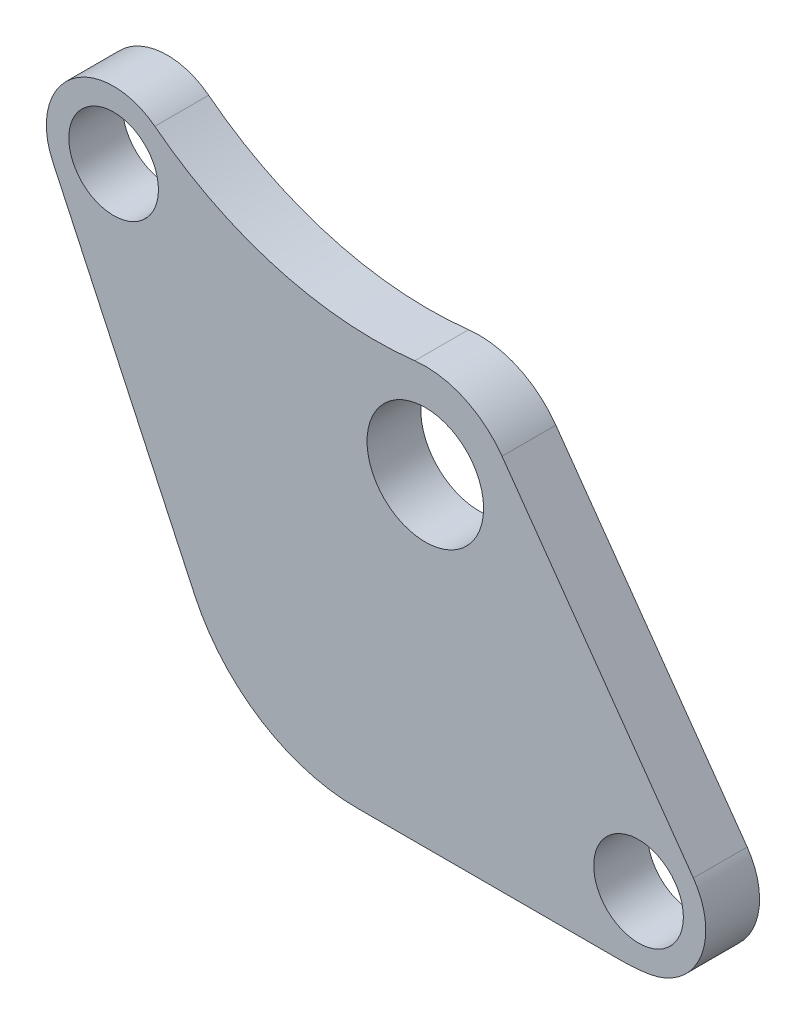
ISO-10303-21;
HEADER;
FILE_DESCRIPTION(('STEP AP214'),'2;1');
FILE_NAME('part.step','',(''),(''),'','','');
FILE_SCHEMA(('AUTOMOTIVE_DESIGN { 1 0 10303 214 1 1 1 1 }'));
ENDSEC;
DATA;
#1=APPLICATION_CONTEXT('core data for automotive mechanical design processes');
#2=APPLICATION_PROTOCOL_DEFINITION('international standard','automotive_design',2000,#1);
#3=PRODUCT_CONTEXT('',#1,'mechanical');
#4=PRODUCT('Part','Part','',(#3));
#5=PRODUCT_RELATED_PRODUCT_CATEGORY('part','',(#4));
#6=PRODUCT_DEFINITION_FORMATION('','',#4);
#7=PRODUCT_DEFINITION_CONTEXT('part definition',#1,'design');
#8=PRODUCT_DEFINITION('design','',#6,#7);
#9=PRODUCT_DEFINITION_SHAPE('','',#8);
#10=(LENGTH_UNIT() NAMED_UNIT(*) SI_UNIT(.MILLI.,.METRE.));
#11=(NAMED_UNIT(*) PLANE_ANGLE_UNIT() SI_UNIT($,.RADIAN.));
#12=(NAMED_UNIT(*) SI_UNIT($,.STERADIAN.) SOLID_ANGLE_UNIT());
#13=UNCERTAINTY_MEASURE_WITH_UNIT(LENGTH_MEASURE(1.E-05),#10,'distance_accuracy_value','');
#14=(GEOMETRIC_REPRESENTATION_CONTEXT(3) GLOBAL_UNCERTAINTY_ASSIGNED_CONTEXT((#13)) GLOBAL_UNIT_ASSIGNED_CONTEXT((#10,
#11,#12)) REPRESENTATION_CONTEXT('',''));
#15=CARTESIAN_POINT('',(0.,0.,0.));
#16=DIRECTION('',(0.,0.,1.));
#17=DIRECTION('',(1.,0.,0.));
#18=AXIS2_PLACEMENT_3D('',#15,#16,#17);
#19=CARTESIAN_POINT('',(-17.3843134845393,6.32737265152489,3.));
#20=DIRECTION('',(0.,0.,1.));
#21=DIRECTION('',(1.,0.,0.));
#22=AXIS2_PLACEMENT_3D('',#19,#20,#21);
#23=PLANE('',#22);
#24=CARTESIAN_POINT('',(11.891570779201,-14.1718221977011,3.));
#25=DIRECTION('',(0.,0.,1.));
#26=DIRECTION('',(1.,0.,0.));
#27=AXIS2_PLACEMENT_3D('',#24,#25,#26);
#28=CIRCLE('',#27,2.5);
#29=CARTESIAN_POINT('',(14.391570779201,-14.1718221977011,3.));
#30=VERTEX_POINT('',#29);
#31=EDGE_CURVE('E208',#30,#30,#28,.T.);
#32=ORIENTED_EDGE('',*,*,#31,.F.);
#33=EDGE_LOOP('',(#32));
#34=FACE_BOUND('',#33,.T.);
#35=DIRECTION('',(0.422618261740697,-0.906307787036651,0.));
#36=VECTOR('',#35,1.);
#37=CARTESIAN_POINT('',(-20.7829676859267,4.74255416999728,3.));
#38=LINE('',#37,#36);
#39=CARTESIAN_POINT('',(-20.7829676859267,4.74255416999728,3.));
#40=VERTEX_POINT('',#39);
#41=CARTESIAN_POINT('',(-12.8703157727437,-12.226182617407,3.));
#42=VERTEX_POINT('',#41);
#43=EDGE_CURVE('E107',#40,#42,#38,.T.);
#44=ORIENTED_EDGE('',*,*,#43,.T.);
#45=CARTESIAN_POINT('',(-3.80723790237724,-8.,3.));
#46=DIRECTION('',(0.,0.,1.));
#47=DIRECTION('',(1.,0.,0.));
#48=AXIS2_PLACEMENT_3D('',#45,#46,#47);
#49=CIRCLE('',#48,10.);
#50=CARTESIAN_POINT('',(-3.80723790237724,-18.,3.));
#51=VERTEX_POINT('',#50);
#52=EDGE_CURVE('E11',#42,#51,#49,.T.);
#53=ORIENTED_EDGE('',*,*,#52,.T.);
#54=DIRECTION('',(1.,0.,0.));
#55=VECTOR('',#54,1.);
#56=CARTESIAN_POINT('',(-10.1779405104522,-18.,3.));
#57=LINE('',#56,#55);
#58=CARTESIAN_POINT('',(10.9061212574274,-18.,3.));
#59=VERTEX_POINT('',#58);
#60=EDGE_CURVE('E116',#51,#59,#57,.T.);
#61=ORIENTED_EDGE('',*,*,#60,.T.);
#62=CARTESIAN_POINT('',(10.9061212574274,-8.,3.));
#63=DIRECTION('',(0.,0.,1.));
#64=DIRECTION('',(1.,0.,0.));
#65=AXIS2_PLACEMENT_3D('',#62,#63,#64);
#66=CIRCLE('',#65,10.);
#67=CARTESIAN_POINT('',(12.4828404922651,-17.8749155163218,3.));
#68=VERTEX_POINT('',#67);
#69=EDGE_CURVE('E199',#59,#68,#66,.T.);
#70=ORIENTED_EDGE('',*,*,#69,.T.);
#71=CARTESIAN_POINT('',(11.891570779201,-14.1718221977011,3.));
#72=DIRECTION('',(0.,0.,1.));
#73=DIRECTION('',(1.,0.,0.));
#74=AXIS2_PLACEMENT_3D('',#71,#72,#73);
#75=CIRCLE('',#74,3.75);
#76=CARTESIAN_POINT('',(14.9499384171909,-12.0018251030265,3.));
#77=VERTEX_POINT('',#76);
#78=EDGE_CURVE('E196',#68,#77,#75,.T.);
#79=ORIENTED_EDGE('',*,*,#78,.T.);
#80=DIRECTION('',(-0.578665891913218,0.815564703463974,0.));
#81=VECTOR('',#80,1.);
#82=CARTESIAN_POINT('',(4.27975347553941,3.03660439395303,3.));
#83=LINE('',#82,#81);
#84=CARTESIAN_POINT('',(4.27975347553941,3.03660439395303,3.));
#85=VERTEX_POINT('',#84);
#86=EDGE_CURVE('E193',#77,#85,#83,.T.);
#87=ORIENTED_EDGE('',*,*,#86,.T.);
#88=CARTESIAN_POINT('',(0.,0.,3.));
#89=DIRECTION('',(0.,0.,1.));
#90=DIRECTION('',(-1.,0.,0.));
#91=AXIS2_PLACEMENT_3D('',#88,#89,#90);
#92=CIRCLE('',#91,5.24759526419164);
#93=CARTESIAN_POINT('',(-0.58661243137298,5.21470439355149,3.));
#94=VERTEX_POINT('',#93);
#95=EDGE_CURVE('E190',#85,#94,#92,.T.);
#96=ORIENTED_EDGE('',*,*,#95,.T.);
#97=CARTESIAN_POINT('',(-2.82235052411761,25.0893484200655,3.));
#98=DIRECTION('',(0.,0.,-1.));
#99=DIRECTION('',(1.,0.,0.));
#100=AXIS2_PLACEMENT_3D('',#97,#98,#99);
#101=CIRCLE('',#100,20.);
#102=CARTESIAN_POINT('',(-15.085056174999,9.28978987813658,3.));
#103=VERTEX_POINT('',#102);
#104=EDGE_CURVE('E122',#94,#103,#101,.T.);
#105=ORIENTED_EDGE('',*,*,#104,.T.);
#106=CARTESIAN_POINT('',(-17.3843134845393,6.32737265152489,3.));
#107=DIRECTION('',(0.,0.,1.));
#108=DIRECTION('',(1.,0.,0.));
#109=AXIS2_PLACEMENT_3D('',#106,#107,#108);
#110=CIRCLE('',#109,3.75);
#111=EDGE_CURVE('E117',#103,#40,#110,.T.);
#112=ORIENTED_EDGE('',*,*,#111,.T.);
#113=EDGE_LOOP('',(#44,#53,#61,#70,#79,#87,#96,#105,#112));
#114=FACE_BOUND('',#113,.T.);
#115=CARTESIAN_POINT('',(-17.3843134845393,6.32737265152489,3.));
#116=DIRECTION('',(0.,0.,1.));
#117=DIRECTION('',(1.,0.,0.));
#118=AXIS2_PLACEMENT_3D('',#115,#116,#117);
#119=CIRCLE('',#118,2.5);
#120=CARTESIAN_POINT('',(-14.8843134845393,6.32737265152489,3.));
#121=VERTEX_POINT('',#120);
#122=EDGE_CURVE('E187',#121,#121,#119,.T.);
#123=ORIENTED_EDGE('',*,*,#122,.F.);
#124=EDGE_LOOP('',(#123));
#125=FACE_BOUND('',#124,.T.);
#126=CARTESIAN_POINT('',(0.,0.,3.));
#127=DIRECTION('',(0.,0.,1.));
#128=DIRECTION('',(1.,0.,0.));
#129=AXIS2_PLACEMENT_3D('',#126,#127,#128);
#130=CIRCLE('',#129,3.25);
#131=CARTESIAN_POINT('',(3.25,0.,3.));
#132=VERTEX_POINT('',#131);
#133=EDGE_CURVE('E216',#132,#132,#130,.T.);
#134=ORIENTED_EDGE('',*,*,#133,.F.);
#135=EDGE_LOOP('',(#134));
#136=FACE_BOUND('',#135,.T.);
#137=ADVANCED_FACE('F39',(#34,#114,#125,#136),#23,.T.);
#138=CARTESIAN_POINT('',(-17.3843134845393,6.32737265152489,0.));
#139=DIRECTION('',(0.,0.,1.));
#140=DIRECTION('',(1.,0.,0.));
#141=AXIS2_PLACEMENT_3D('',#138,#139,#140);
#142=PLANE('',#141);
#143=DIRECTION('',(1.,0.,0.));
#144=VECTOR('',#143,1.);
#145=CARTESIAN_POINT('',(-10.1779405104522,-18.,0.));
#146=LINE('',#145,#144);
#147=CARTESIAN_POINT('',(-3.80723790237724,-18.,0.));
#148=VERTEX_POINT('',#147);
#149=CARTESIAN_POINT('',(10.9061212574274,-18.,0.));
#150=VERTEX_POINT('',#149);
#151=EDGE_CURVE('E179',#148,#150,#146,.T.);
#152=ORIENTED_EDGE('',*,*,#151,.F.);
#153=CARTESIAN_POINT('',(-3.80723790237724,-8.,0.));
#154=DIRECTION('',(0.,0.,1.));
#155=DIRECTION('',(1.,0.,0.));
#156=AXIS2_PLACEMENT_3D('',#153,#154,#155);
#157=CIRCLE('',#156,10.);
#158=CARTESIAN_POINT('',(-12.8703157727437,-12.226182617407,0.));
#159=VERTEX_POINT('',#158);
#160=EDGE_CURVE('E62',#148,#159,#157,.F.);
#161=ORIENTED_EDGE('',*,*,#160,.T.);
#162=DIRECTION('',(0.422618261740697,-0.906307787036651,0.));
#163=VECTOR('',#162,1.);
#164=CARTESIAN_POINT('',(-20.7829676859267,4.74255416999728,0.));
#165=LINE('',#164,#163);
#166=CARTESIAN_POINT('',(-20.7829676859267,4.74255416999728,0.));
#167=VERTEX_POINT('',#166);
#168=EDGE_CURVE('E182',#167,#159,#165,.T.);
#169=ORIENTED_EDGE('',*,*,#168,.F.);
#170=CARTESIAN_POINT('',(-17.3843134845393,6.32737265152489,0.));
#171=DIRECTION('',(0.,0.,1.));
#172=DIRECTION('',(1.,0.,0.));
#173=AXIS2_PLACEMENT_3D('',#170,#171,#172);
#174=CIRCLE('',#173,3.75);
#175=CARTESIAN_POINT('',(-15.085056174999,9.28978987813658,0.));
#176=VERTEX_POINT('',#175);
#177=EDGE_CURVE('E131',#176,#167,#174,.T.);
#178=ORIENTED_EDGE('',*,*,#177,.F.);
#179=CARTESIAN_POINT('',(-2.82235052411761,25.0893484200655,0.));
#180=DIRECTION('',(0.,0.,-1.));
#181=DIRECTION('',(1.,0.,0.));
#182=AXIS2_PLACEMENT_3D('',#179,#180,#181);
#183=CIRCLE('',#182,20.);
#184=CARTESIAN_POINT('',(-0.58661243137298,5.21470439355149,0.));
#185=VERTEX_POINT('',#184);
#186=EDGE_CURVE('E127',#185,#176,#183,.T.);
#187=ORIENTED_EDGE('',*,*,#186,.F.);
#188=CARTESIAN_POINT('',(0.,0.,0.));
#189=DIRECTION('',(0.,0.,1.));
#190=DIRECTION('',(-1.,0.,0.));
#191=AXIS2_PLACEMENT_3D('',#188,#189,#190);
#192=CIRCLE('',#191,5.24759526419164);
#193=CARTESIAN_POINT('',(4.27975347553941,3.03660439395303,0.));
#194=VERTEX_POINT('',#193);
#195=EDGE_CURVE('E167',#194,#185,#192,.T.);
#196=ORIENTED_EDGE('',*,*,#195,.F.);
#197=DIRECTION('',(-0.578665891913218,0.815564703463974,0.));
#198=VECTOR('',#197,1.);
#199=CARTESIAN_POINT('',(4.27975347553941,3.03660439395303,0.));
#200=LINE('',#199,#198);
#201=CARTESIAN_POINT('',(14.9499384171909,-12.0018251030265,0.));
#202=VERTEX_POINT('',#201);
#203=EDGE_CURVE('E170',#202,#194,#200,.T.);
#204=ORIENTED_EDGE('',*,*,#203,.F.);
#205=CARTESIAN_POINT('',(11.891570779201,-14.1718221977011,0.));
#206=DIRECTION('',(0.,0.,1.));
#207=DIRECTION('',(1.,0.,0.));
#208=AXIS2_PLACEMENT_3D('',#205,#206,#207);
#209=CIRCLE('',#208,3.75);
#210=CARTESIAN_POINT('',(12.4828404922651,-17.8749155163218,0.));
#211=VERTEX_POINT('',#210);
#212=EDGE_CURVE('E173',#211,#202,#209,.T.);
#213=ORIENTED_EDGE('',*,*,#212,.F.);
#214=CARTESIAN_POINT('',(10.9061212574274,-8.,0.));
#215=DIRECTION('',(0.,0.,1.));
#216=DIRECTION('',(1.,0.,0.));
#217=AXIS2_PLACEMENT_3D('',#214,#215,#216);
#218=CIRCLE('',#217,10.);
#219=EDGE_CURVE('E176',#150,#211,#218,.T.);
#220=ORIENTED_EDGE('',*,*,#219,.F.);
#221=EDGE_LOOP('',(#152,#161,#169,#178,#187,#196,#204,#213,#220));
#222=FACE_BOUND('',#221,.T.);
#223=CARTESIAN_POINT('',(-17.3843134845393,6.32737265152489,0.));
#224=DIRECTION('',(0.,0.,1.));
#225=DIRECTION('',(1.,0.,0.));
#226=AXIS2_PLACEMENT_3D('',#223,#224,#225);
#227=CIRCLE('',#226,2.5);
#228=CARTESIAN_POINT('',(-14.8843134845393,6.32737265152489,0.));
#229=VERTEX_POINT('',#228);
#230=EDGE_CURVE('E204',#229,#229,#227,.T.);
#231=ORIENTED_EDGE('',*,*,#230,.T.);
#232=EDGE_LOOP('',(#231));
#233=FACE_BOUND('',#232,.T.);
#234=CARTESIAN_POINT('',(11.891570779201,-14.1718221977011,0.));
#235=DIRECTION('',(0.,0.,1.));
#236=DIRECTION('',(1.,0.,0.));
#237=AXIS2_PLACEMENT_3D('',#234,#235,#236);
#238=CIRCLE('',#237,2.5);
#239=CARTESIAN_POINT('',(14.391570779201,-14.1718221977011,0.));
#240=VERTEX_POINT('',#239);
#241=EDGE_CURVE('E212',#240,#240,#238,.T.);
#242=ORIENTED_EDGE('',*,*,#241,.T.);
#243=EDGE_LOOP('',(#242));
#244=FACE_BOUND('',#243,.T.);
#245=CARTESIAN_POINT('',(0.,0.,0.));
#246=DIRECTION('',(0.,0.,1.));
#247=DIRECTION('',(1.,0.,0.));
#248=AXIS2_PLACEMENT_3D('',#245,#246,#247);
#249=CIRCLE('',#248,3.25);
#250=CARTESIAN_POINT('',(3.25,0.,0.));
#251=VERTEX_POINT('',#250);
#252=EDGE_CURVE('E220',#251,#251,#249,.T.);
#253=ORIENTED_EDGE('',*,*,#252,.T.);
#254=EDGE_LOOP('',(#253));
#255=FACE_BOUND('',#254,.T.);
#256=ADVANCED_FACE('F232',(#222,#233,#244,#255),#142,.F.);
#257=CARTESIAN_POINT('',(-17.3843134845393,6.32737265152489,3.));
#258=DIRECTION('',(0.,0.,-1.));
#259=DIRECTION('',(-1.,0.,0.));
#260=AXIS2_PLACEMENT_3D('',#257,#258,#259);
#261=CYLINDRICAL_SURFACE('',#260,3.75);
#262=ORIENTED_EDGE('',*,*,#177,.T.);
#263=DIRECTION('',(0.,0.,-1.));
#264=VECTOR('',#263,1.);
#265=CARTESIAN_POINT('',(-20.7829676859267,4.74255416999728,3.));
#266=LINE('',#265,#264);
#267=EDGE_CURVE('E111',#40,#167,#266,.T.);
#268=ORIENTED_EDGE('',*,*,#267,.F.);
#269=ORIENTED_EDGE('',*,*,#111,.F.);
#270=DIRECTION('',(0.,0.,-1.));
#271=VECTOR('',#270,1.);
#272=CARTESIAN_POINT('',(-15.085056174999,9.28978987813658,3.));
#273=LINE('',#272,#271);
#274=EDGE_CURVE('E162',#103,#176,#273,.T.);
#275=ORIENTED_EDGE('',*,*,#274,.T.);
#276=EDGE_LOOP('',(#262,#268,#269,#275));
#277=FACE_BOUND('',#276,.T.);
#278=ADVANCED_FACE('F129',(#277),#261,.T.);
#279=CARTESIAN_POINT('',(-20.7829676859267,4.74255416999728,3.));
#280=DIRECTION('',(0.906307787036651,0.422618261740697,0.));
#281=DIRECTION('',(-0.422618261740697,0.906307787036651,0.));
#282=AXIS2_PLACEMENT_3D('',#279,#280,#281);
#283=PLANE('',#282);
#284=ORIENTED_EDGE('',*,*,#168,.T.);
#285=DIRECTION('',(0.,0.,-1.));
#286=VECTOR('',#285,1.);
#287=CARTESIAN_POINT('',(-12.8703157727437,-12.226182617407,3.));
#288=LINE('',#287,#286);
#289=EDGE_CURVE('E48',#159,#42,#288,.F.);
#290=ORIENTED_EDGE('',*,*,#289,.T.);
#291=ORIENTED_EDGE('',*,*,#43,.F.);
#292=ORIENTED_EDGE('',*,*,#267,.T.);
#293=EDGE_LOOP('',(#284,#290,#291,#292));
#294=FACE_BOUND('',#293,.T.);
#295=ADVANCED_FACE('F109',(#294),#283,.F.);
#296=CARTESIAN_POINT('',(-10.1779405104522,-18.,3.));
#297=DIRECTION('',(0.,1.,0.));
#298=DIRECTION('',(-1.,0.,0.));
#299=AXIS2_PLACEMENT_3D('',#296,#297,#298);
#300=PLANE('',#299);
#301=ORIENTED_EDGE('',*,*,#60,.F.);
#302=DIRECTION('',(0.,0.,-1.));
#303=VECTOR('',#302,1.);
#304=CARTESIAN_POINT('',(-3.80723790237724,-18.,3.));
#305=LINE('',#304,#303);
#306=EDGE_CURVE('E133',#51,#148,#305,.T.);
#307=ORIENTED_EDGE('',*,*,#306,.T.);
#308=ORIENTED_EDGE('',*,*,#151,.T.);
#309=DIRECTION('',(0.,0.,-1.));
#310=VECTOR('',#309,1.);
#311=CARTESIAN_POINT('',(10.9061212574274,-18.,3.));
#312=LINE('',#311,#310);
#313=EDGE_CURVE('E134',#59,#150,#312,.T.);
#314=ORIENTED_EDGE('',*,*,#313,.F.);
#315=EDGE_LOOP('',(#301,#307,#308,#314));
#316=FACE_BOUND('',#315,.T.);
#317=ADVANCED_FACE('F263',(#316),#300,.F.);
#318=CARTESIAN_POINT('',(10.9061212574274,-8.,3.));
#319=DIRECTION('',(0.,0.,-1.));
#320=DIRECTION('',(-1.,0.,0.));
#321=AXIS2_PLACEMENT_3D('',#318,#319,#320);
#322=CYLINDRICAL_SURFACE('',#321,10.);
#323=ORIENTED_EDGE('',*,*,#219,.T.);
#324=DIRECTION('',(0.,0.,-1.));
#325=VECTOR('',#324,1.);
#326=CARTESIAN_POINT('',(12.4828404922651,-17.8749155163218,3.));
#327=LINE('',#326,#325);
#328=EDGE_CURVE('E141',#68,#211,#327,.T.);
#329=ORIENTED_EDGE('',*,*,#328,.F.);
#330=ORIENTED_EDGE('',*,*,#69,.F.);
#331=ORIENTED_EDGE('',*,*,#313,.T.);
#332=EDGE_LOOP('',(#323,#329,#330,#331));
#333=FACE_BOUND('',#332,.T.);
#334=ADVANCED_FACE('F259',(#333),#322,.T.);
#335=CARTESIAN_POINT('',(11.891570779201,-14.1718221977011,3.));
#336=DIRECTION('',(0.,0.,-1.));
#337=DIRECTION('',(-1.,0.,0.));
#338=AXIS2_PLACEMENT_3D('',#335,#336,#337);
#339=CYLINDRICAL_SURFACE('',#338,3.75);
#340=ORIENTED_EDGE('',*,*,#212,.T.);
#341=DIRECTION('',(0.,0.,-1.));
#342=VECTOR('',#341,1.);
#343=CARTESIAN_POINT('',(14.9499384171909,-12.0018251030265,3.));
#344=LINE('',#343,#342);
#345=EDGE_CURVE('E150',#77,#202,#344,.T.);
#346=ORIENTED_EDGE('',*,*,#345,.F.);
#347=ORIENTED_EDGE('',*,*,#78,.F.);
#348=ORIENTED_EDGE('',*,*,#328,.T.);
#349=EDGE_LOOP('',(#340,#346,#347,#348));
#350=FACE_BOUND('',#349,.T.);
#351=ADVANCED_FACE('F255',(#350),#339,.T.);
#352=CARTESIAN_POINT('',(4.27975347553941,3.03660439395303,3.));
#353=DIRECTION('',(-0.815564703463974,-0.578665891913218,0.));
#354=DIRECTION('',(0.578665891913218,-0.815564703463974,0.));
#355=AXIS2_PLACEMENT_3D('',#352,#353,#354);
#356=PLANE('',#355);
#357=ORIENTED_EDGE('',*,*,#203,.T.);
#358=DIRECTION('',(0.,0.,-1.));
#359=VECTOR('',#358,1.);
#360=CARTESIAN_POINT('',(4.27975347553941,3.03660439395303,3.));
#361=LINE('',#360,#359);
#362=EDGE_CURVE('E154',#85,#194,#361,.T.);
#363=ORIENTED_EDGE('',*,*,#362,.F.);
#364=ORIENTED_EDGE('',*,*,#86,.F.);
#365=ORIENTED_EDGE('',*,*,#345,.T.);
#366=EDGE_LOOP('',(#357,#363,#364,#365));
#367=FACE_BOUND('',#366,.T.);
#368=ADVANCED_FACE('F251',(#367),#356,.F.);
#369=CARTESIAN_POINT('',(0.,0.,3.));
#370=DIRECTION('',(0.,0.,-1.));
#371=DIRECTION('',(-1.,0.,0.));
#372=AXIS2_PLACEMENT_3D('',#369,#370,#371);
#373=CYLINDRICAL_SURFACE('',#372,5.24759526419164);
#374=ORIENTED_EDGE('',*,*,#195,.T.);
#375=DIRECTION('',(0.,0.,-1.));
#376=VECTOR('',#375,1.);
#377=CARTESIAN_POINT('',(-0.58661243137298,5.21470439355149,3.));
#378=LINE('',#377,#376);
#379=EDGE_CURVE('E158',#94,#185,#378,.T.);
#380=ORIENTED_EDGE('',*,*,#379,.F.);
#381=ORIENTED_EDGE('',*,*,#95,.F.);
#382=ORIENTED_EDGE('',*,*,#362,.T.);
#383=EDGE_LOOP('',(#374,#380,#381,#382));
#384=FACE_BOUND('',#383,.T.);
#385=ADVANCED_FACE('F247',(#384),#373,.T.);
#386=CARTESIAN_POINT('',(-2.82235052411761,25.0893484200655,3.));
#387=DIRECTION('',(0.,0.,-1.));
#388=DIRECTION('',(-1.,0.,0.));
#389=AXIS2_PLACEMENT_3D('',#386,#387,#388);
#390=CYLINDRICAL_SURFACE('',#389,20.);
#391=ORIENTED_EDGE('',*,*,#186,.T.);
#392=ORIENTED_EDGE('',*,*,#274,.F.);
#393=ORIENTED_EDGE('',*,*,#104,.F.);
#394=ORIENTED_EDGE('',*,*,#379,.T.);
#395=EDGE_LOOP('',(#391,#392,#393,#394));
#396=FACE_BOUND('',#395,.T.);
#397=ADVANCED_FACE('F244',(#396),#390,.F.);
#398=CARTESIAN_POINT('',(-17.3843134845393,6.32737265152489,3.));
#399=DIRECTION('',(0.,0.,-1.));
#400=DIRECTION('',(-1.,0.,0.));
#401=AXIS2_PLACEMENT_3D('',#398,#399,#400);
#402=CYLINDRICAL_SURFACE('',#401,2.5);
#403=ORIENTED_EDGE('',*,*,#122,.T.);
#404=EDGE_LOOP('',(#403));
#405=FACE_BOUND('',#404,.T.);
#406=ORIENTED_EDGE('',*,*,#230,.F.);
#407=EDGE_LOOP('',(#406));
#408=FACE_BOUND('',#407,.T.);
#409=ADVANCED_FACE('F241',(#405,#408),#402,.F.);
#410=CARTESIAN_POINT('',(11.891570779201,-14.1718221977011,3.));
#411=DIRECTION('',(0.,0.,-1.));
#412=DIRECTION('',(-1.,0.,0.));
#413=AXIS2_PLACEMENT_3D('',#410,#411,#412);
#414=CYLINDRICAL_SURFACE('',#413,2.5);
#415=ORIENTED_EDGE('',*,*,#31,.T.);
#416=EDGE_LOOP('',(#415));
#417=FACE_BOUND('',#416,.T.);
#418=ORIENTED_EDGE('',*,*,#241,.F.);
#419=EDGE_LOOP('',(#418));
#420=FACE_BOUND('',#419,.T.);
#421=ADVANCED_FACE('F309',(#417,#420),#414,.F.);
#422=CARTESIAN_POINT('',(0.,0.,3.));
#423=DIRECTION('',(0.,0.,-1.));
#424=DIRECTION('',(-1.,0.,0.));
#425=AXIS2_PLACEMENT_3D('',#422,#423,#424);
#426=CYLINDRICAL_SURFACE('',#425,3.25);
#427=ORIENTED_EDGE('',*,*,#133,.T.);
#428=EDGE_LOOP('',(#427));
#429=FACE_BOUND('',#428,.T.);
#430=ORIENTED_EDGE('',*,*,#252,.F.);
#431=EDGE_LOOP('',(#430));
#432=FACE_BOUND('',#431,.T.);
#433=ADVANCED_FACE('F228',(#429,#432),#426,.F.);
#434=CARTESIAN_POINT('',(-3.80723790237724,-8.,3.));
#435=DIRECTION('',(0.,0.,-1.));
#436=DIRECTION('',(-1.,0.,0.));
#437=AXIS2_PLACEMENT_3D('',#434,#435,#436);
#438=CYLINDRICAL_SURFACE('',#437,10.);
#439=ORIENTED_EDGE('',*,*,#52,.F.);
#440=ORIENTED_EDGE('',*,*,#289,.F.);
#441=ORIENTED_EDGE('',*,*,#160,.F.);
#442=ORIENTED_EDGE('',*,*,#306,.F.);
#443=EDGE_LOOP('',(#439,#440,#441,#442));
#444=FACE_BOUND('',#443,.T.);
#445=ADVANCED_FACE('F41',(#444),#438,.T.);
#446=CLOSED_SHELL('',(#137,#256,#278,#295,#317,#334,#351,#368,#385,#397,#409,#421,#433,#445));
#447=MANIFOLD_SOLID_BREP('B2',#446);
#448=ADVANCED_BREP_SHAPE_REPRESENTATION('',(#18,#447),#14);
#449=SHAPE_DEFINITION_REPRESENTATION(#9,#448);
ENDSEC;
END-ISO-10303-21;
